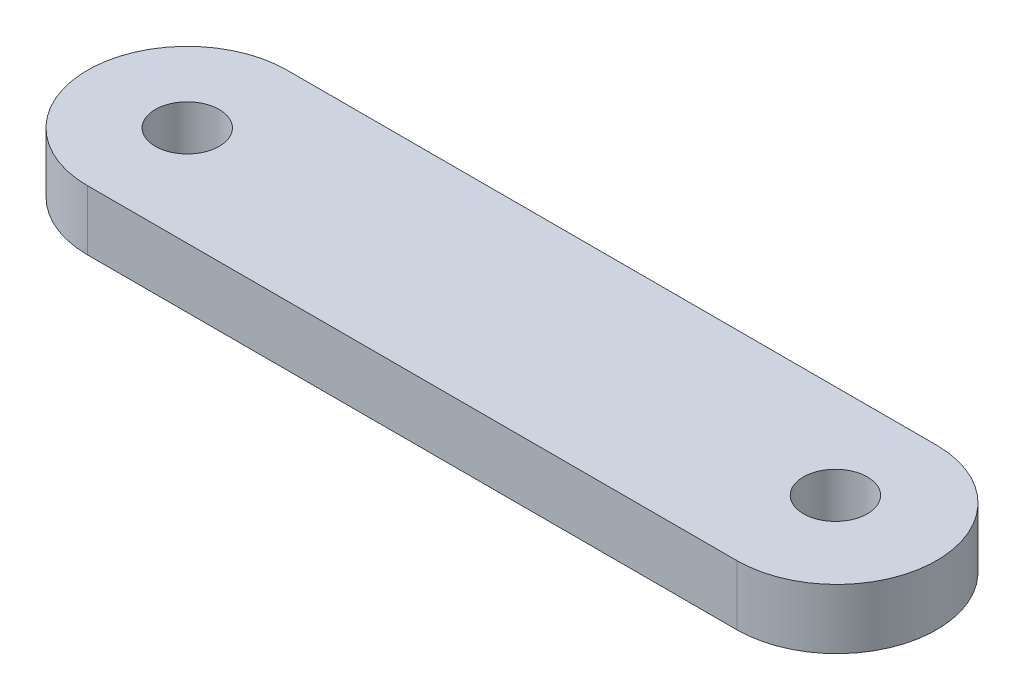
ISO-10303-21;
HEADER;
FILE_DESCRIPTION(('STEP AP214'),'2;1');
FILE_NAME('part.step','',(''),(''),'','','');
FILE_SCHEMA(('AUTOMOTIVE_DESIGN { 1 0 10303 214 1 1 1 1 }'));
ENDSEC;
DATA;
#1=APPLICATION_CONTEXT('core data for automotive mechanical design processes');
#2=APPLICATION_PROTOCOL_DEFINITION('international standard','automotive_design',2000,#1);
#3=PRODUCT_CONTEXT('',#1,'mechanical');
#4=PRODUCT('Part','Part','',(#3));
#5=PRODUCT_RELATED_PRODUCT_CATEGORY('part','',(#4));
#6=PRODUCT_DEFINITION_FORMATION('','',#4);
#7=PRODUCT_DEFINITION_CONTEXT('part definition',#1,'design');
#8=PRODUCT_DEFINITION('design','',#6,#7);
#9=PRODUCT_DEFINITION_SHAPE('','',#8);
#10=(LENGTH_UNIT() NAMED_UNIT(*) SI_UNIT(.MILLI.,.METRE.));
#11=(NAMED_UNIT(*) PLANE_ANGLE_UNIT() SI_UNIT($,.RADIAN.));
#12=(NAMED_UNIT(*) SI_UNIT($,.STERADIAN.) SOLID_ANGLE_UNIT());
#13=UNCERTAINTY_MEASURE_WITH_UNIT(LENGTH_MEASURE(1.E-05),#10,'distance_accuracy_value','');
#14=(GEOMETRIC_REPRESENTATION_CONTEXT(3) GLOBAL_UNCERTAINTY_ASSIGNED_CONTEXT((#13)) GLOBAL_UNIT_ASSIGNED_CONTEXT((#10,
#11,#12)) REPRESENTATION_CONTEXT('',''));
#15=CARTESIAN_POINT('',(0.,0.,0.));
#16=DIRECTION('',(0.,0.,1.));
#17=DIRECTION('',(1.,0.,0.));
#18=AXIS2_PLACEMENT_3D('',#15,#16,#17);
#19=CARTESIAN_POINT('',(-37.6642512077294,3.,3.87499999999999));
#20=DIRECTION('',(0.,1.,0.));
#21=DIRECTION('',(0.,0.,1.));
#22=AXIS2_PLACEMENT_3D('',#19,#20,#21);
#23=PLANE('',#22);
#24=CARTESIAN_POINT('',(-37.6642512077294,3.,3.87499999999999));
#25=DIRECTION('',(0.,1.,0.));
#26=DIRECTION('',(0.,0.,1.));
#27=AXIS2_PLACEMENT_3D('',#24,#25,#26);
#28=CIRCLE('',#27,1.6);
#29=CARTESIAN_POINT('',(-37.6642512077294,3.,5.47499999999998));
#30=VERTEX_POINT('',#29);
#31=EDGE_CURVE('E104',#30,#30,#28,.T.);
#32=ORIENTED_EDGE('',*,*,#31,.F.);
#33=EDGE_LOOP('',(#32));
#34=FACE_BOUND('',#33,.T.);
#35=CARTESIAN_POINT('',(-37.6642512077294,3.,3.87499999999999));
#36=DIRECTION('',(0.,1.,0.));
#37=DIRECTION('',(0.,0.,1.));
#38=AXIS2_PLACEMENT_3D('',#35,#36,#37);
#39=CIRCLE('',#38,5.);
#40=CARTESIAN_POINT('',(-37.6642512077294,3.,-1.12500000000001));
#41=VERTEX_POINT('',#40);
#42=CARTESIAN_POINT('',(-37.6642512077294,3.,8.87499999999999));
#43=VERTEX_POINT('',#42);
#44=EDGE_CURVE('E89',#41,#43,#39,.T.);
#45=ORIENTED_EDGE('',*,*,#44,.T.);
#46=DIRECTION('',(1.,0.,0.));
#47=VECTOR('',#46,1.);
#48=CARTESIAN_POINT('',(-37.6642512077294,3.,8.87499999999999));
#49=LINE('',#48,#47);
#50=CARTESIAN_POINT('',(-5.16425120772943,3.,8.87499999999999));
#51=VERTEX_POINT('',#50);
#52=EDGE_CURVE('E84',#43,#51,#49,.T.);
#53=ORIENTED_EDGE('',*,*,#52,.T.);
#54=CARTESIAN_POINT('',(-5.16425120772943,3.,3.87499999999999));
#55=DIRECTION('',(0.,1.,0.));
#56=DIRECTION('',(0.,0.,1.));
#57=AXIS2_PLACEMENT_3D('',#54,#55,#56);
#58=CIRCLE('',#57,5.);
#59=CARTESIAN_POINT('',(-5.16425120772943,3.,-1.12500000000001));
#60=VERTEX_POINT('',#59);
#61=EDGE_CURVE('E87',#51,#60,#58,.T.);
#62=ORIENTED_EDGE('',*,*,#61,.T.);
#63=DIRECTION('',(-1.,0.,0.));
#64=VECTOR('',#63,1.);
#65=CARTESIAN_POINT('',(-37.6642512077294,3.,-1.12500000000001));
#66=LINE('',#65,#64);
#67=EDGE_CURVE('E54',#60,#41,#66,.T.);
#68=ORIENTED_EDGE('',*,*,#67,.T.);
#69=EDGE_LOOP('',(#45,#53,#62,#68));
#70=FACE_BOUND('',#69,.T.);
#71=CARTESIAN_POINT('',(-5.52442378027784,3.,3.5824630220565));
#72=DIRECTION('',(0.,1.,0.));
#73=DIRECTION('',(0.,0.,1.));
#74=AXIS2_PLACEMENT_3D('',#71,#72,#73);
#75=CIRCLE('',#74,1.60000000000001);
#76=CARTESIAN_POINT('',(-5.52442378027784,3.,5.18246302205651));
#77=VERTEX_POINT('',#76);
#78=EDGE_CURVE('E119',#77,#77,#75,.T.);
#79=ORIENTED_EDGE('',*,*,#78,.F.);
#80=EDGE_LOOP('',(#79));
#81=FACE_BOUND('',#80,.T.);
#82=ADVANCED_FACE('F37',(#34,#70,#81),#23,.T.);
#83=CARTESIAN_POINT('',(-37.6642512077294,0.,3.87499999999999));
#84=DIRECTION('',(0.,1.,0.));
#85=DIRECTION('',(0.,0.,1.));
#86=AXIS2_PLACEMENT_3D('',#83,#84,#85);
#87=PLANE('',#86);
#88=CARTESIAN_POINT('',(-37.6642512077294,0.,3.87499999999999));
#89=DIRECTION('',(0.,1.,0.));
#90=DIRECTION('',(0.,0.,1.));
#91=AXIS2_PLACEMENT_3D('',#88,#89,#90);
#92=CIRCLE('',#91,5.);
#93=CARTESIAN_POINT('',(-37.6642512077294,0.,-1.12500000000001));
#94=VERTEX_POINT('',#93);
#95=CARTESIAN_POINT('',(-37.6642512077294,0.,8.87499999999999));
#96=VERTEX_POINT('',#95);
#97=EDGE_CURVE('E101',#94,#96,#92,.T.);
#98=ORIENTED_EDGE('',*,*,#97,.F.);
#99=DIRECTION('',(-1.,0.,0.));
#100=VECTOR('',#99,1.);
#101=CARTESIAN_POINT('',(-37.6642512077294,0.,-1.12500000000001));
#102=LINE('',#101,#100);
#103=CARTESIAN_POINT('',(-5.16425120772943,0.,-1.12500000000001));
#104=VERTEX_POINT('',#103);
#105=EDGE_CURVE('E77',#104,#94,#102,.T.);
#106=ORIENTED_EDGE('',*,*,#105,.F.);
#107=CARTESIAN_POINT('',(-5.16425120772943,0.,3.87499999999999));
#108=DIRECTION('',(0.,1.,0.));
#109=DIRECTION('',(0.,0.,1.));
#110=AXIS2_PLACEMENT_3D('',#107,#108,#109);
#111=CIRCLE('',#110,5.);
#112=CARTESIAN_POINT('',(-5.16425120772943,0.,8.87499999999999));
#113=VERTEX_POINT('',#112);
#114=EDGE_CURVE('E71',#113,#104,#111,.T.);
#115=ORIENTED_EDGE('',*,*,#114,.F.);
#116=DIRECTION('',(1.,0.,0.));
#117=VECTOR('',#116,1.);
#118=CARTESIAN_POINT('',(-37.6642512077294,0.,8.87499999999999));
#119=LINE('',#118,#117);
#120=EDGE_CURVE('E93',#96,#113,#119,.T.);
#121=ORIENTED_EDGE('',*,*,#120,.F.);
#122=EDGE_LOOP('',(#98,#106,#115,#121));
#123=FACE_BOUND('',#122,.T.);
#124=CARTESIAN_POINT('',(-37.6642512077294,0.,3.87499999999999));
#125=DIRECTION('',(0.,1.,0.));
#126=DIRECTION('',(0.,0.,1.));
#127=AXIS2_PLACEMENT_3D('',#124,#125,#126);
#128=CIRCLE('',#127,1.6);
#129=CARTESIAN_POINT('',(-37.6642512077294,0.,5.47499999999998));
#130=VERTEX_POINT('',#129);
#131=EDGE_CURVE('E116',#130,#130,#128,.T.);
#132=ORIENTED_EDGE('',*,*,#131,.T.);
#133=EDGE_LOOP('',(#132));
#134=FACE_BOUND('',#133,.T.);
#135=CARTESIAN_POINT('',(-5.52442378027784,0.,3.5824630220565));
#136=DIRECTION('',(0.,1.,0.));
#137=DIRECTION('',(0.,0.,1.));
#138=AXIS2_PLACEMENT_3D('',#135,#136,#137);
#139=CIRCLE('',#138,1.60000000000001);
#140=CARTESIAN_POINT('',(-5.52442378027784,0.,5.18246302205651));
#141=VERTEX_POINT('',#140);
#142=EDGE_CURVE('E122',#141,#141,#139,.T.);
#143=ORIENTED_EDGE('',*,*,#142,.T.);
#144=EDGE_LOOP('',(#143));
#145=FACE_BOUND('',#144,.T.);
#146=ADVANCED_FACE('F112',(#123,#134,#145),#87,.F.);
#147=CARTESIAN_POINT('',(-37.6642512077294,3.,3.87499999999999));
#148=DIRECTION('',(0.,-1.,0.));
#149=DIRECTION('',(0.,0.,-1.));
#150=AXIS2_PLACEMENT_3D('',#147,#148,#149);
#151=CYLINDRICAL_SURFACE('',#150,5.);
#152=ORIENTED_EDGE('',*,*,#97,.T.);
#153=DIRECTION('',(0.,-1.,0.));
#154=VECTOR('',#153,1.);
#155=CARTESIAN_POINT('',(-37.6642512077294,3.,8.87499999999999));
#156=LINE('',#155,#154);
#157=EDGE_CURVE('E11',#43,#96,#156,.T.);
#158=ORIENTED_EDGE('',*,*,#157,.F.);
#159=ORIENTED_EDGE('',*,*,#44,.F.);
#160=DIRECTION('',(0.,-1.,0.));
#161=VECTOR('',#160,1.);
#162=CARTESIAN_POINT('',(-37.6642512077294,3.,-1.12500000000001));
#163=LINE('',#162,#161);
#164=EDGE_CURVE('E97',#41,#94,#163,.T.);
#165=ORIENTED_EDGE('',*,*,#164,.T.);
#166=EDGE_LOOP('',(#152,#158,#159,#165));
#167=FACE_BOUND('',#166,.T.);
#168=ADVANCED_FACE('F39',(#167),#151,.T.);
#169=CARTESIAN_POINT('',(-37.6642512077294,3.,8.87499999999999));
#170=DIRECTION('',(0.,0.,-1.));
#171=DIRECTION('',(-1.,0.,0.));
#172=AXIS2_PLACEMENT_3D('',#169,#170,#171);
#173=PLANE('',#172);
#174=ORIENTED_EDGE('',*,*,#120,.T.);
#175=DIRECTION('',(0.,-1.,0.));
#176=VECTOR('',#175,1.);
#177=CARTESIAN_POINT('',(-5.16425120772943,3.,8.87499999999999));
#178=LINE('',#177,#176);
#179=EDGE_CURVE('E46',#51,#113,#178,.T.);
#180=ORIENTED_EDGE('',*,*,#179,.F.);
#181=ORIENTED_EDGE('',*,*,#52,.F.);
#182=ORIENTED_EDGE('',*,*,#157,.T.);
#183=EDGE_LOOP('',(#174,#180,#181,#182));
#184=FACE_BOUND('',#183,.T.);
#185=ADVANCED_FACE('F92',(#184),#173,.F.);
#186=CARTESIAN_POINT('',(-5.16425120772943,3.,3.87499999999999));
#187=DIRECTION('',(0.,-1.,0.));
#188=DIRECTION('',(0.,0.,-1.));
#189=AXIS2_PLACEMENT_3D('',#186,#187,#188);
#190=CYLINDRICAL_SURFACE('',#189,5.);
#191=ORIENTED_EDGE('',*,*,#114,.T.);
#192=DIRECTION('',(0.,-1.,0.));
#193=VECTOR('',#192,1.);
#194=CARTESIAN_POINT('',(-5.16425120772943,3.,-1.12500000000001));
#195=LINE('',#194,#193);
#196=EDGE_CURVE('E94',#60,#104,#195,.T.);
#197=ORIENTED_EDGE('',*,*,#196,.F.);
#198=ORIENTED_EDGE('',*,*,#61,.F.);
#199=ORIENTED_EDGE('',*,*,#179,.T.);
#200=EDGE_LOOP('',(#191,#197,#198,#199));
#201=FACE_BOUND('',#200,.T.);
#202=ADVANCED_FACE('F95',(#201),#190,.T.);
#203=CARTESIAN_POINT('',(-37.6642512077294,3.,-1.12500000000001));
#204=DIRECTION('',(0.,0.,1.));
#205=DIRECTION('',(1.,0.,0.));
#206=AXIS2_PLACEMENT_3D('',#203,#204,#205);
#207=PLANE('',#206);
#208=ORIENTED_EDGE('',*,*,#105,.T.);
#209=ORIENTED_EDGE('',*,*,#164,.F.);
#210=ORIENTED_EDGE('',*,*,#67,.F.);
#211=ORIENTED_EDGE('',*,*,#196,.T.);
#212=EDGE_LOOP('',(#208,#209,#210,#211));
#213=FACE_BOUND('',#212,.T.);
#214=ADVANCED_FACE('F109',(#213),#207,.F.);
#215=CARTESIAN_POINT('',(-37.6642512077294,3.,3.87499999999999));
#216=DIRECTION('',(0.,-1.,0.));
#217=DIRECTION('',(0.,0.,-1.));
#218=AXIS2_PLACEMENT_3D('',#215,#216,#217);
#219=CYLINDRICAL_SURFACE('',#218,1.6);
#220=ORIENTED_EDGE('',*,*,#31,.T.);
#221=EDGE_LOOP('',(#220));
#222=FACE_BOUND('',#221,.T.);
#223=ORIENTED_EDGE('',*,*,#131,.F.);
#224=EDGE_LOOP('',(#223));
#225=FACE_BOUND('',#224,.T.);
#226=ADVANCED_FACE('F139',(#222,#225),#219,.F.);
#227=CARTESIAN_POINT('',(-5.52442378027784,3.,3.5824630220565));
#228=DIRECTION('',(0.,-1.,0.));
#229=DIRECTION('',(0.,0.,-1.));
#230=AXIS2_PLACEMENT_3D('',#227,#228,#229);
#231=CYLINDRICAL_SURFACE('',#230,1.60000000000001);
#232=ORIENTED_EDGE('',*,*,#78,.T.);
#233=EDGE_LOOP('',(#232));
#234=FACE_BOUND('',#233,.T.);
#235=ORIENTED_EDGE('',*,*,#142,.F.);
#236=EDGE_LOOP('',(#235));
#237=FACE_BOUND('',#236,.T.);
#238=ADVANCED_FACE('F128',(#234,#237),#231,.F.);
#239=CLOSED_SHELL('',(#82,#146,#168,#185,#202,#214,#226,#238));
#240=MANIFOLD_SOLID_BREP('B2',#239);
#241=ADVANCED_BREP_SHAPE_REPRESENTATION('',(#18,#240),#14);
#242=SHAPE_DEFINITION_REPRESENTATION(#9,#241);
ENDSEC;
END-ISO-10303-21;
